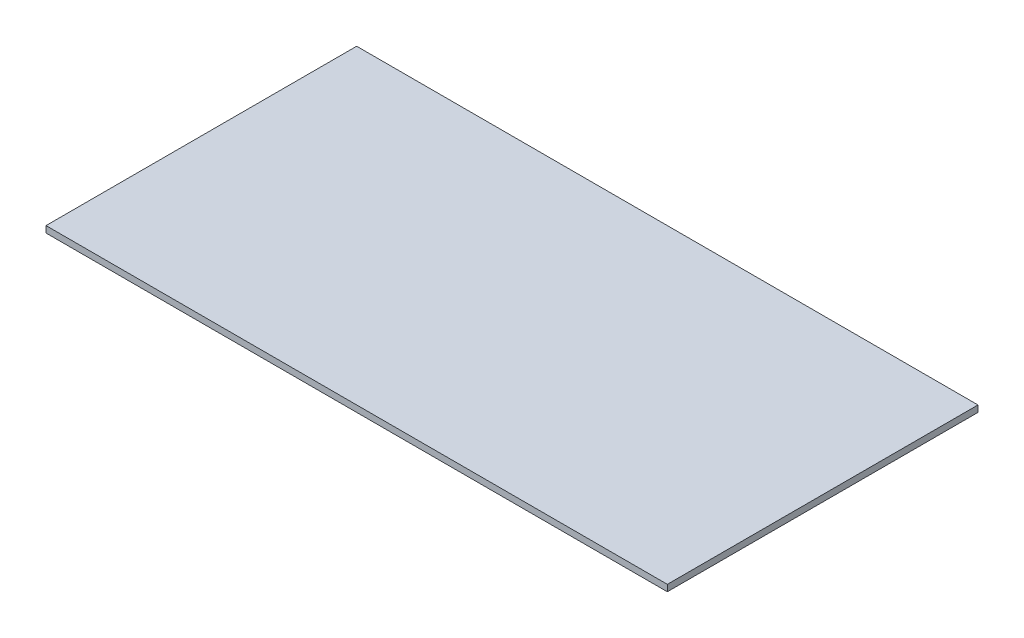
ISO-10303-21;
HEADER;
FILE_DESCRIPTION(('STEP AP214'),'2;1');
FILE_NAME('part.step','',(''),(''),'','','');
FILE_SCHEMA(('AUTOMOTIVE_DESIGN { 1 0 10303 214 1 1 1 1 }'));
ENDSEC;
DATA;
#1=APPLICATION_CONTEXT('core data for automotive mechanical design processes');
#2=APPLICATION_PROTOCOL_DEFINITION('international standard','automotive_design',2000,#1);
#3=PRODUCT_CONTEXT('',#1,'mechanical');
#4=PRODUCT('Part','Part','',(#3));
#5=PRODUCT_RELATED_PRODUCT_CATEGORY('part','',(#4));
#6=PRODUCT_DEFINITION_FORMATION('','',#4);
#7=PRODUCT_DEFINITION_CONTEXT('part definition',#1,'design');
#8=PRODUCT_DEFINITION('design','',#6,#7);
#9=PRODUCT_DEFINITION_SHAPE('','',#8);
#10=(LENGTH_UNIT() NAMED_UNIT(*) SI_UNIT(.MILLI.,.METRE.));
#11=(NAMED_UNIT(*) PLANE_ANGLE_UNIT() SI_UNIT($,.RADIAN.));
#12=(NAMED_UNIT(*) SI_UNIT($,.STERADIAN.) SOLID_ANGLE_UNIT());
#13=UNCERTAINTY_MEASURE_WITH_UNIT(LENGTH_MEASURE(1.E-05),#10,'distance_accuracy_value','');
#14=(GEOMETRIC_REPRESENTATION_CONTEXT(3) GLOBAL_UNCERTAINTY_ASSIGNED_CONTEXT((#13)) GLOBAL_UNIT_ASSIGNED_CONTEXT((#10,
#11,#12)) REPRESENTATION_CONTEXT('',''));
#15=CARTESIAN_POINT('',(0.,0.,0.));
#16=DIRECTION('',(0.,0.,1.));
#17=DIRECTION('',(1.,0.,0.));
#18=AXIS2_PLACEMENT_3D('',#15,#16,#17);
#19=CARTESIAN_POINT('',(0.,12.7,0.));
#20=DIRECTION('',(1.,0.,0.));
#21=DIRECTION('',(0.,0.,-1.));
#22=AXIS2_PLACEMENT_3D('',#19,#20,#21);
#23=PLANE('',#22);
#24=DIRECTION('',(0.,0.,1.));
#25=VECTOR('',#24,1.);
#26=CARTESIAN_POINT('',(0.,0.,0.));
#27=LINE('',#26,#25);
#28=CARTESIAN_POINT('',(0.,0.,-609.6));
#29=VERTEX_POINT('',#28);
#30=CARTESIAN_POINT('',(0.,0.,0.));
#31=VERTEX_POINT('',#30);
#32=EDGE_CURVE('E94',#29,#31,#27,.T.);
#33=ORIENTED_EDGE('',*,*,#32,.T.);
#34=DIRECTION('',(0.,-1.,0.));
#35=VECTOR('',#34,1.);
#36=CARTESIAN_POINT('',(0.,12.7,0.));
#37=LINE('',#36,#35);
#38=CARTESIAN_POINT('',(0.,12.7,0.));
#39=VERTEX_POINT('',#38);
#40=EDGE_CURVE('E11',#39,#31,#37,.T.);
#41=ORIENTED_EDGE('',*,*,#40,.F.);
#42=DIRECTION('',(0.,0.,1.));
#43=VECTOR('',#42,1.);
#44=CARTESIAN_POINT('',(0.,12.7,0.));
#45=LINE('',#44,#43);
#46=CARTESIAN_POINT('',(0.,12.7,-609.6));
#47=VERTEX_POINT('',#46);
#48=EDGE_CURVE('E82',#47,#39,#45,.T.);
#49=ORIENTED_EDGE('',*,*,#48,.F.);
#50=DIRECTION('',(0.,-1.,0.));
#51=VECTOR('',#50,1.);
#52=CARTESIAN_POINT('',(0.,12.7,-609.6));
#53=LINE('',#52,#51);
#54=EDGE_CURVE('E90',#47,#29,#53,.T.);
#55=ORIENTED_EDGE('',*,*,#54,.T.);
#56=EDGE_LOOP('',(#33,#41,#49,#55));
#57=FACE_BOUND('',#56,.T.);
#58=ADVANCED_FACE('F31',(#57),#23,.F.);
#59=CARTESIAN_POINT('',(0.,12.7,0.));
#60=DIRECTION('',(0.,0.,-1.));
#61=DIRECTION('',(-1.,0.,0.));
#62=AXIS2_PLACEMENT_3D('',#59,#60,#61);
#63=PLANE('',#62);
#64=DIRECTION('',(1.,0.,0.));
#65=VECTOR('',#64,1.);
#66=CARTESIAN_POINT('',(0.,0.,0.));
#67=LINE('',#66,#65);
#68=CARTESIAN_POINT('',(1219.2,0.,0.));
#69=VERTEX_POINT('',#68);
#70=EDGE_CURVE('E86',#31,#69,#67,.T.);
#71=ORIENTED_EDGE('',*,*,#70,.T.);
#72=DIRECTION('',(0.,-1.,0.));
#73=VECTOR('',#72,1.);
#74=CARTESIAN_POINT('',(1219.2,12.7,0.));
#75=LINE('',#74,#73);
#76=CARTESIAN_POINT('',(1219.2,12.7,0.));
#77=VERTEX_POINT('',#76);
#78=EDGE_CURVE('E39',#77,#69,#75,.T.);
#79=ORIENTED_EDGE('',*,*,#78,.F.);
#80=DIRECTION('',(1.,0.,0.));
#81=VECTOR('',#80,1.);
#82=CARTESIAN_POINT('',(0.,12.7,0.));
#83=LINE('',#82,#81);
#84=EDGE_CURVE('E77',#39,#77,#83,.T.);
#85=ORIENTED_EDGE('',*,*,#84,.F.);
#86=ORIENTED_EDGE('',*,*,#40,.T.);
#87=EDGE_LOOP('',(#71,#79,#85,#86));
#88=FACE_BOUND('',#87,.T.);
#89=ADVANCED_FACE('F85',(#88),#63,.F.);
#90=CARTESIAN_POINT('',(1219.2,12.7,0.));
#91=DIRECTION('',(-1.,0.,0.));
#92=DIRECTION('',(0.,0.,1.));
#93=AXIS2_PLACEMENT_3D('',#90,#91,#92);
#94=PLANE('',#93);
#95=DIRECTION('',(0.,0.,-1.));
#96=VECTOR('',#95,1.);
#97=CARTESIAN_POINT('',(1219.2,0.,0.));
#98=LINE('',#97,#96);
#99=CARTESIAN_POINT('',(1219.2,0.,-609.6));
#100=VERTEX_POINT('',#99);
#101=EDGE_CURVE('E64',#69,#100,#98,.T.);
#102=ORIENTED_EDGE('',*,*,#101,.T.);
#103=DIRECTION('',(0.,-1.,0.));
#104=VECTOR('',#103,1.);
#105=CARTESIAN_POINT('',(1219.2,12.7,-609.6));
#106=LINE('',#105,#104);
#107=CARTESIAN_POINT('',(1219.2,12.7,-609.6));
#108=VERTEX_POINT('',#107);
#109=EDGE_CURVE('E87',#108,#100,#106,.T.);
#110=ORIENTED_EDGE('',*,*,#109,.F.);
#111=DIRECTION('',(0.,0.,-1.));
#112=VECTOR('',#111,1.);
#113=CARTESIAN_POINT('',(1219.2,12.7,0.));
#114=LINE('',#113,#112);
#115=EDGE_CURVE('E80',#77,#108,#114,.T.);
#116=ORIENTED_EDGE('',*,*,#115,.F.);
#117=ORIENTED_EDGE('',*,*,#78,.T.);
#118=EDGE_LOOP('',(#102,#110,#116,#117));
#119=FACE_BOUND('',#118,.T.);
#120=ADVANCED_FACE('F88',(#119),#94,.F.);
#121=CARTESIAN_POINT('',(0.,12.7,-609.6));
#122=DIRECTION('',(0.,0.,1.));
#123=DIRECTION('',(1.,0.,0.));
#124=AXIS2_PLACEMENT_3D('',#121,#122,#123);
#125=PLANE('',#124);
#126=DIRECTION('',(-1.,0.,0.));
#127=VECTOR('',#126,1.);
#128=CARTESIAN_POINT('',(0.,0.,-609.6));
#129=LINE('',#128,#127);
#130=EDGE_CURVE('E70',#100,#29,#129,.T.);
#131=ORIENTED_EDGE('',*,*,#130,.T.);
#132=ORIENTED_EDGE('',*,*,#54,.F.);
#133=DIRECTION('',(-1.,0.,0.));
#134=VECTOR('',#133,1.);
#135=CARTESIAN_POINT('',(0.,12.7,-609.6));
#136=LINE('',#135,#134);
#137=EDGE_CURVE('E47',#108,#47,#136,.T.);
#138=ORIENTED_EDGE('',*,*,#137,.F.);
#139=ORIENTED_EDGE('',*,*,#109,.T.);
#140=EDGE_LOOP('',(#131,#132,#138,#139));
#141=FACE_BOUND('',#140,.T.);
#142=ADVANCED_FACE('F101',(#141),#125,.F.);
#143=CARTESIAN_POINT('',(0.,12.7,-609.6));
#144=DIRECTION('',(0.,-1.,0.));
#145=DIRECTION('',(0.,0.,-1.));
#146=AXIS2_PLACEMENT_3D('',#143,#144,#145);
#147=PLANE('',#146);
#148=ORIENTED_EDGE('',*,*,#48,.T.);
#149=ORIENTED_EDGE('',*,*,#84,.T.);
#150=ORIENTED_EDGE('',*,*,#115,.T.);
#151=ORIENTED_EDGE('',*,*,#137,.T.);
#152=EDGE_LOOP('',(#148,#149,#150,#151));
#153=FACE_BOUND('',#152,.T.);
#154=ADVANCED_FACE('F78',(#153),#147,.F.);
#155=CARTESIAN_POINT('',(0.,0.,-609.6));
#156=DIRECTION('',(0.,-1.,0.));
#157=DIRECTION('',(0.,0.,-1.));
#158=AXIS2_PLACEMENT_3D('',#155,#156,#157);
#159=PLANE('',#158);
#160=ORIENTED_EDGE('',*,*,#32,.F.);
#161=ORIENTED_EDGE('',*,*,#130,.F.);
#162=ORIENTED_EDGE('',*,*,#101,.F.);
#163=ORIENTED_EDGE('',*,*,#70,.F.);
#164=EDGE_LOOP('',(#160,#161,#162,#163));
#165=FACE_BOUND('',#164,.T.);
#166=ADVANCED_FACE('F104',(#165),#159,.T.);
#167=CLOSED_SHELL('',(#58,#89,#120,#142,#154,#166));
#168=MANIFOLD_SOLID_BREP('B2',#167);
#169=ADVANCED_BREP_SHAPE_REPRESENTATION('',(#18,#168),#14);
#170=SHAPE_DEFINITION_REPRESENTATION(#9,#169);
ENDSEC;
END-ISO-10303-21;
